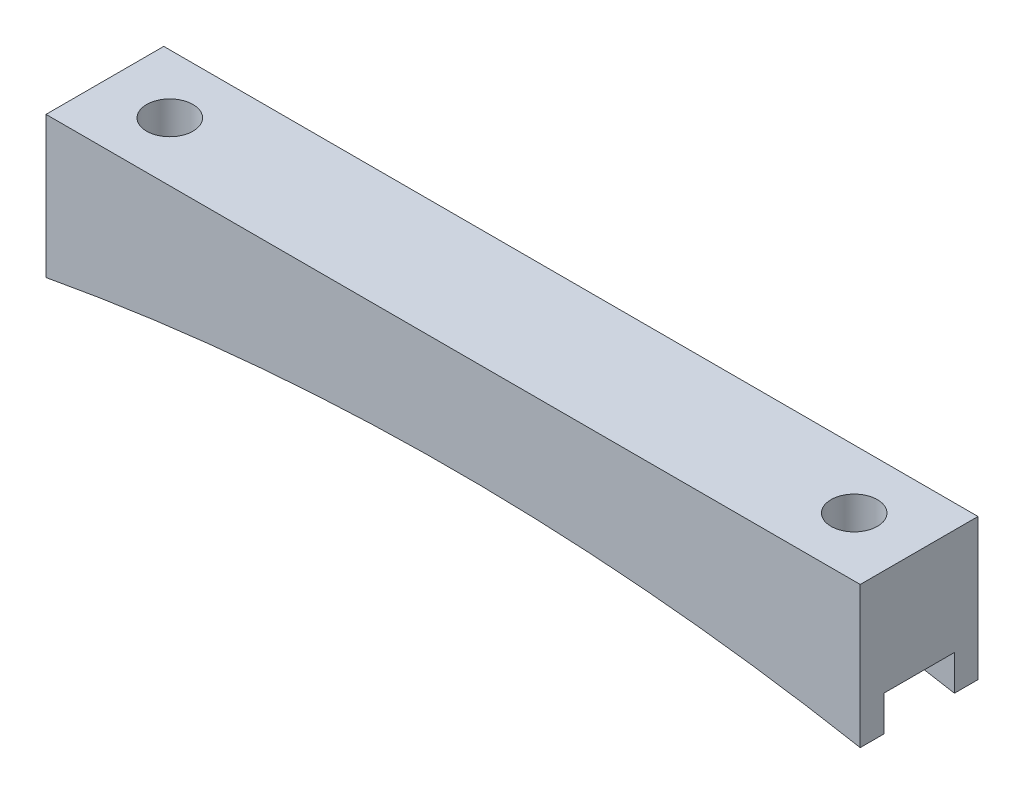
ISO-10303-21;
HEADER;
FILE_DESCRIPTION(('STEP AP214'),'2;1');
FILE_NAME('part.step','',(''),(''),'','','');
FILE_SCHEMA(('AUTOMOTIVE_DESIGN { 1 0 10303 214 1 1 1 1 }'));
ENDSEC;
DATA;
#1=APPLICATION_CONTEXT('core data for automotive mechanical design processes');
#2=APPLICATION_PROTOCOL_DEFINITION('international standard','automotive_design',2000,#1);
#3=PRODUCT_CONTEXT('',#1,'mechanical');
#4=PRODUCT('Part','Part','',(#3));
#5=PRODUCT_RELATED_PRODUCT_CATEGORY('part','',(#4));
#6=PRODUCT_DEFINITION_FORMATION('','',#4);
#7=PRODUCT_DEFINITION_CONTEXT('part definition',#1,'design');
#8=PRODUCT_DEFINITION('design','',#6,#7);
#9=PRODUCT_DEFINITION_SHAPE('','',#8);
#10=(LENGTH_UNIT() NAMED_UNIT(*) SI_UNIT(.MILLI.,.METRE.));
#11=(NAMED_UNIT(*) PLANE_ANGLE_UNIT() SI_UNIT($,.RADIAN.));
#12=(NAMED_UNIT(*) SI_UNIT($,.STERADIAN.) SOLID_ANGLE_UNIT());
#13=UNCERTAINTY_MEASURE_WITH_UNIT(LENGTH_MEASURE(1.E-05),#10,'distance_accuracy_value','');
#14=(GEOMETRIC_REPRESENTATION_CONTEXT(3) GLOBAL_UNCERTAINTY_ASSIGNED_CONTEXT((#13)) GLOBAL_UNIT_ASSIGNED_CONTEXT((#10,
#11,#12)) REPRESENTATION_CONTEXT('',''));
#15=CARTESIAN_POINT('',(0.,0.,0.));
#16=DIRECTION('',(0.,0.,1.));
#17=DIRECTION('',(1.,0.,0.));
#18=AXIS2_PLACEMENT_3D('',#15,#16,#17);
#19=CARTESIAN_POINT('',(43.905,0.,12.7));
#20=DIRECTION('',(-1.,0.,0.));
#21=DIRECTION('',(0.,0.,1.));
#22=AXIS2_PLACEMENT_3D('',#19,#20,#21);
#23=PLANE('',#22);
#24=DIRECTION('',(0.,0.,-1.));
#25=VECTOR('',#24,1.);
#26=CARTESIAN_POINT('',(43.905,-15.24,12.7));
#27=LINE('',#26,#25);
#28=CARTESIAN_POINT('',(43.905,-15.24,12.7));
#29=VERTEX_POINT('',#28);
#30=CARTESIAN_POINT('',(43.905,-15.24,10.16));
#31=VERTEX_POINT('',#30);
#32=EDGE_CURVE('E144',#29,#31,#27,.T.);
#33=ORIENTED_EDGE('',*,*,#32,.T.);
#34=DIRECTION('',(0.,-1.,0.));
#35=VECTOR('',#34,1.);
#36=CARTESIAN_POINT('',(43.905,-15.24,10.16));
#37=LINE('',#36,#35);
#38=CARTESIAN_POINT('',(43.905,-11.43,10.16));
#39=VERTEX_POINT('',#38);
#40=EDGE_CURVE('E168',#39,#31,#37,.T.);
#41=ORIENTED_EDGE('',*,*,#40,.F.);
#42=DIRECTION('',(0.,0.,1.));
#43=VECTOR('',#42,1.);
#44=CARTESIAN_POINT('',(43.905,-11.43,10.16));
#45=LINE('',#44,#43);
#46=CARTESIAN_POINT('',(43.905,-11.43,2.54));
#47=VERTEX_POINT('',#46);
#48=EDGE_CURVE('E132',#47,#39,#45,.T.);
#49=ORIENTED_EDGE('',*,*,#48,.F.);
#50=DIRECTION('',(0.,1.,0.));
#51=VECTOR('',#50,1.);
#52=CARTESIAN_POINT('',(43.905,-15.24,2.54));
#53=LINE('',#52,#51);
#54=CARTESIAN_POINT('',(43.905,-15.24,2.54));
#55=VERTEX_POINT('',#54);
#56=EDGE_CURVE('E161',#55,#47,#53,.T.);
#57=ORIENTED_EDGE('',*,*,#56,.F.);
#58=CARTESIAN_POINT('',(43.905,-15.24,0.));
#59=VERTEX_POINT('',#58);
#60=EDGE_CURVE('E158',#55,#59,#27,.T.);
#61=ORIENTED_EDGE('',*,*,#60,.T.);
#62=DIRECTION('',(0.,1.,0.));
#63=VECTOR('',#62,1.);
#64=CARTESIAN_POINT('',(43.905,0.,0.));
#65=LINE('',#64,#63);
#66=CARTESIAN_POINT('',(43.905,0.,0.));
#67=VERTEX_POINT('',#66);
#68=EDGE_CURVE('E188',#59,#67,#65,.T.);
#69=ORIENTED_EDGE('',*,*,#68,.T.);
#70=DIRECTION('',(0.,0.,-1.));
#71=VECTOR('',#70,1.);
#72=CARTESIAN_POINT('',(43.905,0.,12.7));
#73=LINE('',#72,#71);
#74=CARTESIAN_POINT('',(43.905,0.,12.7));
#75=VERTEX_POINT('',#74);
#76=EDGE_CURVE('E142',#75,#67,#73,.T.);
#77=ORIENTED_EDGE('',*,*,#76,.F.);
#78=DIRECTION('',(0.,1.,0.));
#79=VECTOR('',#78,1.);
#80=CARTESIAN_POINT('',(43.905,0.,12.7));
#81=LINE('',#80,#79);
#82=EDGE_CURVE('E191',#29,#75,#81,.T.);
#83=ORIENTED_EDGE('',*,*,#82,.F.);
#84=EDGE_LOOP('',(#33,#41,#49,#57,#61,#69,#77,#83));
#85=FACE_BOUND('',#84,.T.);
#86=ADVANCED_FACE('F37',(#85),#23,.F.);
#87=CARTESIAN_POINT('',(-43.905,0.,12.7));
#88=DIRECTION('',(0.,-1.,0.));
#89=DIRECTION('',(1.,0.,0.));
#90=AXIS2_PLACEMENT_3D('',#87,#88,#89);
#91=PLANE('',#90);
#92=CARTESIAN_POINT('',(-36.905,0.,6.35));
#93=DIRECTION('',(0.,1.,0.));
#94=DIRECTION('',(-1.,0.,0.));
#95=AXIS2_PLACEMENT_3D('',#92,#93,#94);
#96=CIRCLE('',#95,2.49999999999999);
#97=CARTESIAN_POINT('',(-39.405,0.,6.35));
#98=VERTEX_POINT('',#97);
#99=EDGE_CURVE('E185',#98,#98,#96,.T.);
#100=ORIENTED_EDGE('',*,*,#99,.F.);
#101=EDGE_LOOP('',(#100));
#102=FACE_BOUND('',#101,.T.);
#103=CARTESIAN_POINT('',(36.905,0.,6.35));
#104=DIRECTION('',(0.,1.,0.));
#105=DIRECTION('',(-1.,0.,0.));
#106=AXIS2_PLACEMENT_3D('',#103,#104,#105);
#107=CIRCLE('',#106,2.5);
#108=CARTESIAN_POINT('',(34.405,0.,6.35));
#109=VERTEX_POINT('',#108);
#110=EDGE_CURVE('E184',#109,#109,#107,.T.);
#111=ORIENTED_EDGE('',*,*,#110,.F.);
#112=EDGE_LOOP('',(#111));
#113=FACE_BOUND('',#112,.T.);
#114=DIRECTION('',(-1.,0.,0.));
#115=VECTOR('',#114,1.);
#116=CARTESIAN_POINT('',(-43.905,0.,0.));
#117=LINE('',#116,#115);
#118=CARTESIAN_POINT('',(-43.905,0.,0.));
#119=VERTEX_POINT('',#118);
#120=EDGE_CURVE('E201',#67,#119,#117,.T.);
#121=ORIENTED_EDGE('',*,*,#120,.T.);
#122=DIRECTION('',(0.,0.,-1.));
#123=VECTOR('',#122,1.);
#124=CARTESIAN_POINT('',(-43.905,0.,12.7));
#125=LINE('',#124,#123);
#126=CARTESIAN_POINT('',(-43.905,0.,12.7));
#127=VERTEX_POINT('',#126);
#128=EDGE_CURVE('E138',#127,#119,#125,.T.);
#129=ORIENTED_EDGE('',*,*,#128,.F.);
#130=DIRECTION('',(-1.,0.,0.));
#131=VECTOR('',#130,1.);
#132=CARTESIAN_POINT('',(-43.905,0.,12.7));
#133=LINE('',#132,#131);
#134=EDGE_CURVE('E194',#75,#127,#133,.T.);
#135=ORIENTED_EDGE('',*,*,#134,.F.);
#136=ORIENTED_EDGE('',*,*,#76,.T.);
#137=EDGE_LOOP('',(#121,#129,#135,#136));
#138=FACE_BOUND('',#137,.T.);
#139=ADVANCED_FACE('F213',(#102,#113,#138),#91,.F.);
#140=CARTESIAN_POINT('',(-43.905,0.,12.7));
#141=DIRECTION('',(1.,0.,0.));
#142=DIRECTION('',(0.,0.,-1.));
#143=AXIS2_PLACEMENT_3D('',#140,#141,#142);
#144=PLANE('',#143);
#145=DIRECTION('',(0.,0.,1.));
#146=VECTOR('',#145,1.);
#147=CARTESIAN_POINT('',(-43.905,-11.43,10.16));
#148=LINE('',#147,#146);
#149=CARTESIAN_POINT('',(-43.905,-11.43,2.54));
#150=VERTEX_POINT('',#149);
#151=CARTESIAN_POINT('',(-43.905,-11.43,10.16));
#152=VERTEX_POINT('',#151);
#153=EDGE_CURVE('E131',#150,#152,#148,.T.);
#154=ORIENTED_EDGE('',*,*,#153,.T.);
#155=DIRECTION('',(0.,-1.,0.));
#156=VECTOR('',#155,1.);
#157=CARTESIAN_POINT('',(-43.905,-15.24,10.16));
#158=LINE('',#157,#156);
#159=CARTESIAN_POINT('',(-43.905,-15.24,10.16));
#160=VERTEX_POINT('',#159);
#161=EDGE_CURVE('E117',#152,#160,#158,.T.);
#162=ORIENTED_EDGE('',*,*,#161,.T.);
#163=DIRECTION('',(0.,0.,-1.));
#164=VECTOR('',#163,1.);
#165=CARTESIAN_POINT('',(-43.905,-15.24,12.7));
#166=LINE('',#165,#164);
#167=CARTESIAN_POINT('',(-43.905,-15.24,12.7));
#168=VERTEX_POINT('',#167);
#169=EDGE_CURVE('E128',#168,#160,#166,.T.);
#170=ORIENTED_EDGE('',*,*,#169,.F.);
#171=DIRECTION('',(0.,-1.,0.));
#172=VECTOR('',#171,1.);
#173=CARTESIAN_POINT('',(-43.905,0.,12.7));
#174=LINE('',#173,#172);
#175=EDGE_CURVE('E197',#127,#168,#174,.T.);
#176=ORIENTED_EDGE('',*,*,#175,.F.);
#177=ORIENTED_EDGE('',*,*,#128,.T.);
#178=DIRECTION('',(0.,-1.,0.));
#179=VECTOR('',#178,1.);
#180=CARTESIAN_POINT('',(-43.905,0.,0.));
#181=LINE('',#180,#179);
#182=CARTESIAN_POINT('',(-43.905,-15.24,0.));
#183=VERTEX_POINT('',#182);
#184=EDGE_CURVE('E203',#119,#183,#181,.T.);
#185=ORIENTED_EDGE('',*,*,#184,.T.);
#186=CARTESIAN_POINT('',(-43.905,-15.24,2.54));
#187=VERTEX_POINT('',#186);
#188=EDGE_CURVE('E139',#187,#183,#166,.T.);
#189=ORIENTED_EDGE('',*,*,#188,.F.);
#190=DIRECTION('',(0.,1.,0.));
#191=VECTOR('',#190,1.);
#192=CARTESIAN_POINT('',(-43.905,-15.24,2.54));
#193=LINE('',#192,#191);
#194=EDGE_CURVE('E60',#187,#150,#193,.T.);
#195=ORIENTED_EDGE('',*,*,#194,.T.);
#196=EDGE_LOOP('',(#154,#162,#170,#176,#177,#185,#189,#195));
#197=FACE_BOUND('',#196,.T.);
#198=ADVANCED_FACE('F126',(#197),#144,.F.);
#199=CARTESIAN_POINT('',(0.,-252.51208216518,12.7));
#200=DIRECTION('',(0.,0.,-1.));
#201=DIRECTION('',(-1.,0.,0.));
#202=AXIS2_PLACEMENT_3D('',#199,#200,#201);
#203=CYLINDRICAL_SURFACE('',#202,241.3);
#204=DIRECTION('',(0.,0.,-1.));
#205=VECTOR('',#204,1.);
#206=CARTESIAN_POINT('',(10.2527878599597,-11.43,12.7));
#207=LINE('',#206,#205);
#208=CARTESIAN_POINT('',(10.2527878599597,-11.4300000000001,2.54));
#209=VERTEX_POINT('',#208);
#210=CARTESIAN_POINT('',(10.2527878599597,-11.43,10.16));
#211=VERTEX_POINT('',#210);
#212=EDGE_CURVE('E156',#209,#211,#207,.F.);
#213=ORIENTED_EDGE('',*,*,#212,.T.);
#214=CARTESIAN_POINT('',(0.,-252.51208216518,10.16));
#215=DIRECTION('',(0.,0.,1.));
#216=DIRECTION('',(1.,0.,0.));
#217=AXIS2_PLACEMENT_3D('',#214,#215,#216);
#218=CIRCLE('',#217,241.3);
#219=EDGE_CURVE('E11',#211,#31,#218,.F.);
#220=ORIENTED_EDGE('',*,*,#219,.T.);
#221=ORIENTED_EDGE('',*,*,#32,.F.);
#222=CARTESIAN_POINT('',(0.,-252.51208216518,12.7));
#223=DIRECTION('',(0.,0.,-1.));
#224=DIRECTION('',(-1.,0.,0.));
#225=AXIS2_PLACEMENT_3D('',#222,#223,#224);
#226=CIRCLE('',#225,241.3);
#227=EDGE_CURVE('E137',#168,#29,#226,.T.);
#228=ORIENTED_EDGE('',*,*,#227,.F.);
#229=ORIENTED_EDGE('',*,*,#169,.T.);
#230=CARTESIAN_POINT('',(-10.2527878599597,-11.43,10.16));
#231=VERTEX_POINT('',#230);
#232=EDGE_CURVE('E40',#160,#231,#218,.F.);
#233=ORIENTED_EDGE('',*,*,#232,.T.);
#234=DIRECTION('',(0.,0.,-1.));
#235=VECTOR('',#234,1.);
#236=CARTESIAN_POINT('',(-10.2527878599597,-11.43,12.7));
#237=LINE('',#236,#235);
#238=CARTESIAN_POINT('',(-10.2527878599597,-11.4300000000001,2.54));
#239=VERTEX_POINT('',#238);
#240=EDGE_CURVE('E181',#231,#239,#237,.T.);
#241=ORIENTED_EDGE('',*,*,#240,.T.);
#242=CARTESIAN_POINT('',(0.,-252.51208216518,2.54));
#243=DIRECTION('',(0.,0.,-1.));
#244=DIRECTION('',(-1.,0.,0.));
#245=AXIS2_PLACEMENT_3D('',#242,#243,#244);
#246=CIRCLE('',#245,241.3);
#247=EDGE_CURVE('E123',#239,#187,#246,.F.);
#248=ORIENTED_EDGE('',*,*,#247,.T.);
#249=ORIENTED_EDGE('',*,*,#188,.T.);
#250=CARTESIAN_POINT('',(0.,-252.51208216518,0.));
#251=DIRECTION('',(0.,0.,-1.));
#252=DIRECTION('',(-1.,0.,0.));
#253=AXIS2_PLACEMENT_3D('',#250,#251,#252);
#254=CIRCLE('',#253,241.3);
#255=EDGE_CURVE('E195',#183,#59,#254,.T.);
#256=ORIENTED_EDGE('',*,*,#255,.T.);
#257=ORIENTED_EDGE('',*,*,#60,.F.);
#258=EDGE_CURVE('E45',#55,#209,#246,.F.);
#259=ORIENTED_EDGE('',*,*,#258,.T.);
#260=EDGE_LOOP('',(#213,#220,#221,#228,#229,#233,#241,#248,#249,#256,#257,#259));
#261=FACE_BOUND('',#260,.T.);
#262=ADVANCED_FACE('F135',(#261),#203,.F.);
#263=CARTESIAN_POINT('',(0.,-252.51208216518,12.7));
#264=DIRECTION('',(0.,0.,-1.));
#265=DIRECTION('',(-1.,0.,0.));
#266=AXIS2_PLACEMENT_3D('',#263,#264,#265);
#267=PLANE('',#266);
#268=ORIENTED_EDGE('',*,*,#82,.T.);
#269=ORIENTED_EDGE('',*,*,#134,.T.);
#270=ORIENTED_EDGE('',*,*,#175,.T.);
#271=ORIENTED_EDGE('',*,*,#227,.T.);
#272=EDGE_LOOP('',(#268,#269,#270,#271));
#273=FACE_BOUND('',#272,.T.);
#274=ADVANCED_FACE('F216',(#273),#267,.F.);
#275=CARTESIAN_POINT('',(0.,-252.51208216518,0.));
#276=DIRECTION('',(0.,0.,-1.));
#277=DIRECTION('',(-1.,0.,0.));
#278=AXIS2_PLACEMENT_3D('',#275,#276,#277);
#279=PLANE('',#278);
#280=ORIENTED_EDGE('',*,*,#68,.F.);
#281=ORIENTED_EDGE('',*,*,#255,.F.);
#282=ORIENTED_EDGE('',*,*,#184,.F.);
#283=ORIENTED_EDGE('',*,*,#120,.F.);
#284=EDGE_LOOP('',(#280,#281,#282,#283));
#285=FACE_BOUND('',#284,.T.);
#286=ADVANCED_FACE('F209',(#285),#279,.T.);
#287=CARTESIAN_POINT('',(36.905,-15.24,6.35));
#288=DIRECTION('',(0.,1.,0.));
#289=DIRECTION('',(-1.,0.,0.));
#290=AXIS2_PLACEMENT_3D('',#287,#288,#289);
#291=CYLINDRICAL_SURFACE('',#290,2.5);
#292=CARTESIAN_POINT('',(36.905,-11.43,6.35));
#293=DIRECTION('',(0.,1.,0.));
#294=DIRECTION('',(0.,0.,1.));
#295=AXIS2_PLACEMENT_3D('',#292,#293,#294);
#296=CIRCLE('',#295,2.5);
#297=CARTESIAN_POINT('',(36.905,-11.43,8.85));
#298=VERTEX_POINT('',#297);
#299=EDGE_CURVE('E152',#298,#298,#296,.F.);
#300=ORIENTED_EDGE('',*,*,#299,.T.);
#301=EDGE_LOOP('',(#300));
#302=FACE_BOUND('',#301,.T.);
#303=ORIENTED_EDGE('',*,*,#110,.T.);
#304=EDGE_LOOP('',(#303));
#305=FACE_BOUND('',#304,.T.);
#306=ADVANCED_FACE('F252',(#302,#305),#291,.F.);
#307=CARTESIAN_POINT('',(-36.905,-15.24,6.35));
#308=DIRECTION('',(0.,1.,0.));
#309=DIRECTION('',(-1.,0.,0.));
#310=AXIS2_PLACEMENT_3D('',#307,#308,#309);
#311=CYLINDRICAL_SURFACE('',#310,2.49999999999999);
#312=CARTESIAN_POINT('',(-36.905,-11.43,6.35));
#313=DIRECTION('',(0.,1.,0.));
#314=DIRECTION('',(0.,0.,1.));
#315=AXIS2_PLACEMENT_3D('',#312,#313,#314);
#316=CIRCLE('',#315,2.49999999999999);
#317=CARTESIAN_POINT('',(-36.905,-11.43,8.84999999999999));
#318=VERTEX_POINT('',#317);
#319=EDGE_CURVE('E150',#318,#318,#316,.F.);
#320=ORIENTED_EDGE('',*,*,#319,.T.);
#321=EDGE_LOOP('',(#320));
#322=FACE_BOUND('',#321,.T.);
#323=ORIENTED_EDGE('',*,*,#99,.T.);
#324=EDGE_LOOP('',(#323));
#325=FACE_BOUND('',#324,.T.);
#326=ADVANCED_FACE('F234',(#322,#325),#311,.F.);
#327=CARTESIAN_POINT('',(-43.905,-11.43,10.16));
#328=DIRECTION('',(0.,1.,0.));
#329=DIRECTION('',(0.,0.,1.));
#330=AXIS2_PLACEMENT_3D('',#327,#328,#329);
#331=PLANE('',#330);
#332=ORIENTED_EDGE('',*,*,#319,.F.);
#333=EDGE_LOOP('',(#332));
#334=FACE_BOUND('',#333,.T.);
#335=DIRECTION('',(1.,0.,0.));
#336=VECTOR('',#335,1.);
#337=CARTESIAN_POINT('',(-43.905,-11.43,10.16));
#338=LINE('',#337,#336);
#339=EDGE_CURVE('E119',#152,#231,#338,.T.);
#340=ORIENTED_EDGE('',*,*,#339,.F.);
#341=ORIENTED_EDGE('',*,*,#153,.F.);
#342=DIRECTION('',(1.,0.,0.));
#343=VECTOR('',#342,1.);
#344=CARTESIAN_POINT('',(-43.905,-11.43,2.54));
#345=LINE('',#344,#343);
#346=EDGE_CURVE('E176',#150,#239,#345,.T.);
#347=ORIENTED_EDGE('',*,*,#346,.T.);
#348=ORIENTED_EDGE('',*,*,#240,.F.);
#349=EDGE_LOOP('',(#340,#341,#347,#348));
#350=FACE_BOUND('',#349,.T.);
#351=ADVANCED_FACE('F226',(#334,#350),#331,.F.);
#352=CARTESIAN_POINT('',(-43.905,-15.24,2.54));
#353=DIRECTION('',(0.,0.,-1.));
#354=DIRECTION('',(-1.,0.,0.));
#355=AXIS2_PLACEMENT_3D('',#352,#353,#354);
#356=PLANE('',#355);
#357=ORIENTED_EDGE('',*,*,#346,.F.);
#358=ORIENTED_EDGE('',*,*,#194,.F.);
#359=ORIENTED_EDGE('',*,*,#247,.F.);
#360=EDGE_LOOP('',(#357,#358,#359));
#361=FACE_BOUND('',#360,.T.);
#362=ADVANCED_FACE('F231',(#361),#356,.F.);
#363=CARTESIAN_POINT('',(-43.905,-15.24,10.16));
#364=DIRECTION('',(0.,0.,1.));
#365=DIRECTION('',(1.,0.,0.));
#366=AXIS2_PLACEMENT_3D('',#363,#364,#365);
#367=PLANE('',#366);
#368=ORIENTED_EDGE('',*,*,#161,.F.);
#369=ORIENTED_EDGE('',*,*,#339,.T.);
#370=ORIENTED_EDGE('',*,*,#232,.F.);
#371=EDGE_LOOP('',(#368,#369,#370));
#372=FACE_BOUND('',#371,.T.);
#373=ADVANCED_FACE('F116',(#372),#367,.F.);
#374=EDGE_CURVE('E175',#211,#39,#338,.T.);
#375=ORIENTED_EDGE('',*,*,#374,.T.);
#376=ORIENTED_EDGE('',*,*,#40,.T.);
#377=ORIENTED_EDGE('',*,*,#219,.F.);
#378=EDGE_LOOP('',(#375,#376,#377));
#379=FACE_BOUND('',#378,.T.);
#380=ADVANCED_FACE('F218',(#379),#367,.F.);
#381=ORIENTED_EDGE('',*,*,#56,.T.);
#382=EDGE_CURVE('E52',#209,#47,#345,.T.);
#383=ORIENTED_EDGE('',*,*,#382,.F.);
#384=ORIENTED_EDGE('',*,*,#258,.F.);
#385=EDGE_LOOP('',(#381,#383,#384));
#386=FACE_BOUND('',#385,.T.);
#387=ADVANCED_FACE('F160',(#386),#356,.F.);
#388=ORIENTED_EDGE('',*,*,#299,.F.);
#389=EDGE_LOOP('',(#388));
#390=FACE_BOUND('',#389,.T.);
#391=ORIENTED_EDGE('',*,*,#382,.T.);
#392=ORIENTED_EDGE('',*,*,#48,.T.);
#393=ORIENTED_EDGE('',*,*,#374,.F.);
#394=ORIENTED_EDGE('',*,*,#212,.F.);
#395=EDGE_LOOP('',(#391,#392,#393,#394));
#396=FACE_BOUND('',#395,.T.);
#397=ADVANCED_FACE('F221',(#390,#396),#331,.F.);
#398=CLOSED_SHELL('',(#86,#139,#198,#262,#274,#286,#306,#326,#351,#362,#373,#380,#387,#397));
#399=MANIFOLD_SOLID_BREP('B2',#398);
#400=ADVANCED_BREP_SHAPE_REPRESENTATION('',(#18,#399),#14);
#401=SHAPE_DEFINITION_REPRESENTATION(#9,#400);
ENDSEC;
END-ISO-10303-21;
